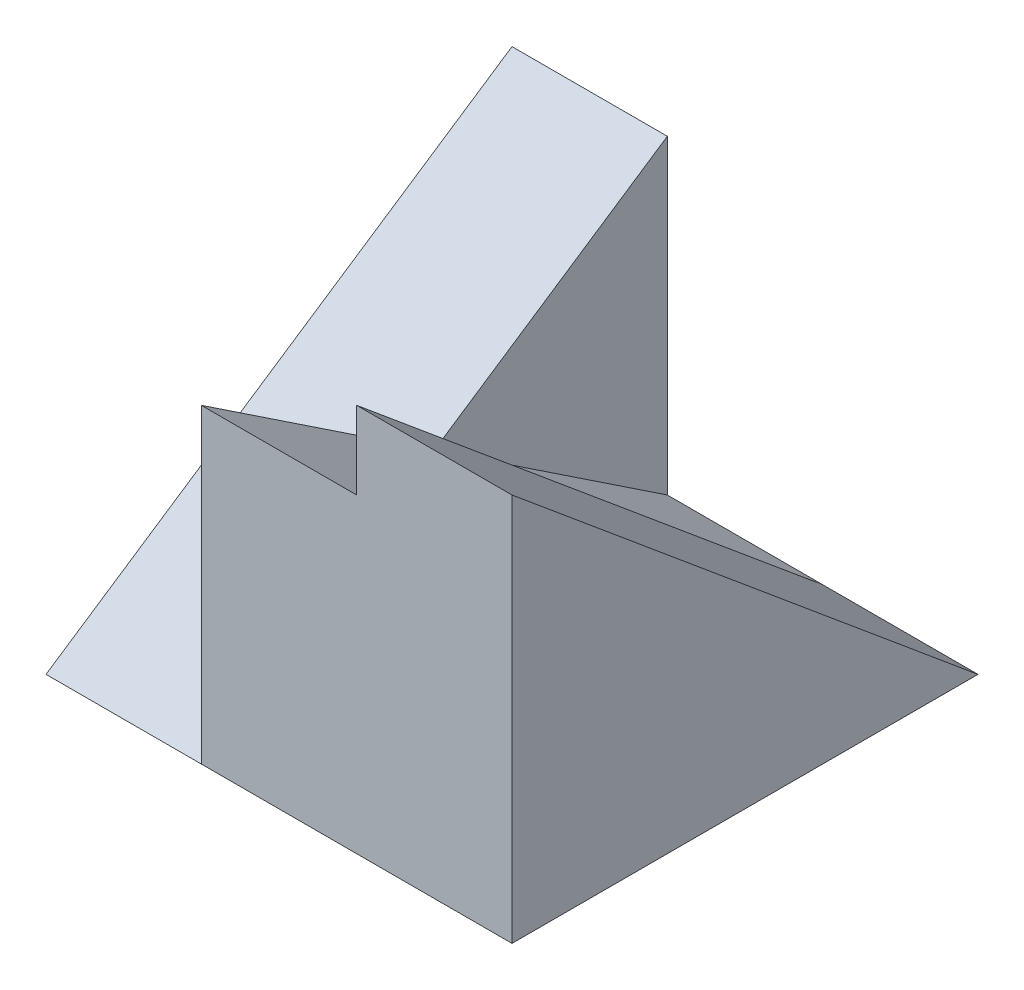
ISO-10303-21;
HEADER;
FILE_DESCRIPTION(('STEP AP214'),'2;1');
FILE_NAME('part.step','',(''),(''),'','','');
FILE_SCHEMA(('AUTOMOTIVE_DESIGN { 1 0 10303 214 1 1 1 1 }'));
ENDSEC;
DATA;
#1=APPLICATION_CONTEXT('core data for automotive mechanical design processes');
#2=APPLICATION_PROTOCOL_DEFINITION('international standard','automotive_design',2000,#1);
#3=PRODUCT_CONTEXT('',#1,'mechanical');
#4=PRODUCT('Part','Part','',(#3));
#5=PRODUCT_RELATED_PRODUCT_CATEGORY('part','',(#4));
#6=PRODUCT_DEFINITION_FORMATION('','',#4);
#7=PRODUCT_DEFINITION_CONTEXT('part definition',#1,'design');
#8=PRODUCT_DEFINITION('design','',#6,#7);
#9=PRODUCT_DEFINITION_SHAPE('','',#8);
#10=(LENGTH_UNIT() NAMED_UNIT(*) SI_UNIT(.MILLI.,.METRE.));
#11=(NAMED_UNIT(*) PLANE_ANGLE_UNIT() SI_UNIT($,.RADIAN.));
#12=(NAMED_UNIT(*) SI_UNIT($,.STERADIAN.) SOLID_ANGLE_UNIT());
#13=UNCERTAINTY_MEASURE_WITH_UNIT(LENGTH_MEASURE(1.E-05),#10,'distance_accuracy_value','');
#14=(GEOMETRIC_REPRESENTATION_CONTEXT(3) GLOBAL_UNCERTAINTY_ASSIGNED_CONTEXT((#13)) GLOBAL_UNIT_ASSIGNED_CONTEXT((#10,
#11,#12)) REPRESENTATION_CONTEXT('',''));
#15=CARTESIAN_POINT('',(0.,0.,0.));
#16=DIRECTION('',(0.,0.,1.));
#17=DIRECTION('',(1.,0.,0.));
#18=AXIS2_PLACEMENT_3D('',#15,#16,#17);
#19=CARTESIAN_POINT('',(3.,5.,3.));
#20=DIRECTION('',(-1.,0.,0.));
#21=DIRECTION('',(0.,0.,1.));
#22=AXIS2_PLACEMENT_3D('',#19,#20,#21);
#23=PLANE('',#22);
#24=DIRECTION('',(0.,-0.64018439966448,-0.768221279597376));
#25=VECTOR('',#24,1.);
#26=CARTESIAN_POINT('',(3.,1.47540983606557,-1.22950819672131));
#27=LINE('',#26,#25);
#28=CARTESIAN_POINT('',(3.,5.,3.));
#29=VERTEX_POINT('',#28);
#30=CARTESIAN_POINT('',(3.,0.,-3.));
#31=VERTEX_POINT('',#30);
#32=EDGE_CURVE('E94',#29,#31,#27,.T.);
#33=ORIENTED_EDGE('',*,*,#32,.F.);
#34=DIRECTION('',(0.,-1.,0.));
#35=VECTOR('',#34,1.);
#36=CARTESIAN_POINT('',(3.,5.,3.));
#37=LINE('',#36,#35);
#38=CARTESIAN_POINT('',(3.,0.,3.));
#39=VERTEX_POINT('',#38);
#40=EDGE_CURVE('E100',#29,#39,#37,.T.);
#41=ORIENTED_EDGE('',*,*,#40,.T.);
#42=DIRECTION('',(0.,0.,-1.));
#43=VECTOR('',#42,1.);
#44=CARTESIAN_POINT('',(3.,0.,3.));
#45=LINE('',#44,#43);
#46=EDGE_CURVE('E106',#39,#31,#45,.T.);
#47=ORIENTED_EDGE('',*,*,#46,.T.);
#48=EDGE_LOOP('',(#33,#41,#47));
#49=FACE_BOUND('',#48,.T.);
#50=ADVANCED_FACE('F33',(#49),#23,.F.);
#51=CARTESIAN_POINT('',(1.,0.,0.));
#52=DIRECTION('',(-1.,0.,0.));
#53=DIRECTION('',(0.,0.,1.));
#54=AXIS2_PLACEMENT_3D('',#51,#52,#53);
#55=PLANE('',#54);
#56=DIRECTION('',(0.,1.,0.));
#57=VECTOR('',#56,1.);
#58=CARTESIAN_POINT('',(1.,0.,3.));
#59=LINE('',#58,#57);
#60=CARTESIAN_POINT('',(1.,4.,3.));
#61=VERTEX_POINT('',#60);
#62=CARTESIAN_POINT('',(1.,5.,3.));
#63=VERTEX_POINT('',#62);
#64=EDGE_CURVE('E135',#61,#63,#59,.T.);
#65=ORIENTED_EDGE('',*,*,#64,.T.);
#66=DIRECTION('',(0.,-0.64018439966448,-0.768221279597376));
#67=VECTOR('',#66,1.);
#68=CARTESIAN_POINT('',(1.,1.47540983606557,-1.22950819672131));
#69=LINE('',#68,#67);
#70=CARTESIAN_POINT('',(1.,0.,-3.));
#71=VERTEX_POINT('',#70);
#72=EDGE_CURVE('E97',#63,#71,#69,.T.);
#73=ORIENTED_EDGE('',*,*,#72,.T.);
#74=DIRECTION('',(0.,0.554700196225229,0.832050294337844));
#75=VECTOR('',#74,1.);
#76=CARTESIAN_POINT('',(1.,1.38461538461538,-0.923076923076923));
#77=LINE('',#76,#75);
#78=EDGE_CURVE('E140',#71,#61,#77,.T.);
#79=ORIENTED_EDGE('',*,*,#78,.T.);
#80=EDGE_LOOP('',(#65,#73,#79));
#81=FACE_BOUND('',#80,.T.);
#82=ADVANCED_FACE('F147',(#81),#55,.T.);
#83=CARTESIAN_POINT('',(-3.,5.,3.));
#84=DIRECTION('',(0.,0.,-1.));
#85=DIRECTION('',(-1.,0.,0.));
#86=AXIS2_PLACEMENT_3D('',#83,#84,#85);
#87=PLANE('',#86);
#88=ORIENTED_EDGE('',*,*,#64,.F.);
#89=DIRECTION('',(-1.,0.,0.));
#90=VECTOR('',#89,1.);
#91=CARTESIAN_POINT('',(1.,4.,3.));
#92=LINE('',#91,#90);
#93=CARTESIAN_POINT('',(-1.,4.,3.));
#94=VERTEX_POINT('',#93);
#95=EDGE_CURVE('E132',#61,#94,#92,.T.);
#96=ORIENTED_EDGE('',*,*,#95,.T.);
#97=DIRECTION('',(0.,1.,0.));
#98=VECTOR('',#97,1.);
#99=CARTESIAN_POINT('',(-1.,0.,3.));
#100=LINE('',#99,#98);
#101=CARTESIAN_POINT('',(-1.,0.,3.));
#102=VERTEX_POINT('',#101);
#103=EDGE_CURVE('E123',#102,#94,#100,.T.);
#104=ORIENTED_EDGE('',*,*,#103,.F.);
#105=DIRECTION('',(1.,0.,0.));
#106=VECTOR('',#105,1.);
#107=CARTESIAN_POINT('',(-3.,0.,3.));
#108=LINE('',#107,#106);
#109=EDGE_CURVE('E54',#102,#39,#108,.T.);
#110=ORIENTED_EDGE('',*,*,#109,.T.);
#111=ORIENTED_EDGE('',*,*,#40,.F.);
#112=DIRECTION('',(1.,0.,0.));
#113=VECTOR('',#112,1.);
#114=CARTESIAN_POINT('',(-3.,5.,3.));
#115=LINE('',#114,#113);
#116=EDGE_CURVE('E91',#63,#29,#115,.T.);
#117=ORIENTED_EDGE('',*,*,#116,.F.);
#118=EDGE_LOOP('',(#88,#96,#104,#110,#111,#117));
#119=FACE_BOUND('',#118,.T.);
#120=ADVANCED_FACE('F108',(#119),#87,.F.);
#121=CARTESIAN_POINT('',(-3.,5.,-3.));
#122=DIRECTION('',(0.,0.,1.));
#123=DIRECTION('',(1.,0.,0.));
#124=AXIS2_PLACEMENT_3D('',#121,#122,#123);
#125=PLANE('',#124);
#126=DIRECTION('',(-1.,0.,0.));
#127=VECTOR('',#126,1.);
#128=CARTESIAN_POINT('',(-1.,4.,-3.));
#129=LINE('',#128,#127);
#130=CARTESIAN_POINT('',(-1.,4.,-3.));
#131=VERTEX_POINT('',#130);
#132=CARTESIAN_POINT('',(-3.,4.,-3.));
#133=VERTEX_POINT('',#132);
#134=EDGE_CURVE('E120',#131,#133,#129,.T.);
#135=ORIENTED_EDGE('',*,*,#134,.F.);
#136=DIRECTION('',(0.,-1.,0.));
#137=VECTOR('',#136,1.);
#138=CARTESIAN_POINT('',(-1.,0.,-3.));
#139=LINE('',#138,#137);
#140=CARTESIAN_POINT('',(-1.,0.,-3.));
#141=VERTEX_POINT('',#140);
#142=EDGE_CURVE('E137',#131,#141,#139,.T.);
#143=ORIENTED_EDGE('',*,*,#142,.T.);
#144=DIRECTION('',(-1.,0.,0.));
#145=VECTOR('',#144,1.);
#146=CARTESIAN_POINT('',(-3.,0.,-3.));
#147=LINE('',#146,#145);
#148=CARTESIAN_POINT('',(-3.,0.,-3.));
#149=VERTEX_POINT('',#148);
#150=EDGE_CURVE('E119',#141,#149,#147,.T.);
#151=ORIENTED_EDGE('',*,*,#150,.T.);
#152=DIRECTION('',(0.,-1.,0.));
#153=VECTOR('',#152,1.);
#154=CARTESIAN_POINT('',(-3.,5.,-3.));
#155=LINE('',#154,#153);
#156=EDGE_CURVE('E40',#133,#149,#155,.T.);
#157=ORIENTED_EDGE('',*,*,#156,.F.);
#158=EDGE_LOOP('',(#135,#143,#151,#157));
#159=FACE_BOUND('',#158,.T.);
#160=ADVANCED_FACE('F158',(#159),#125,.F.);
#161=CARTESIAN_POINT('',(-3.,5.,3.));
#162=DIRECTION('',(1.,0.,0.));
#163=DIRECTION('',(0.,0.,-1.));
#164=AXIS2_PLACEMENT_3D('',#161,#162,#163);
#165=PLANE('',#164);
#166=DIRECTION('',(0.,0.,1.));
#167=VECTOR('',#166,1.);
#168=CARTESIAN_POINT('',(-3.,0.,3.));
#169=LINE('',#168,#167);
#170=CARTESIAN_POINT('',(-3.,0.,3.));
#171=VERTEX_POINT('',#170);
#172=EDGE_CURVE('E114',#149,#171,#169,.T.);
#173=ORIENTED_EDGE('',*,*,#172,.T.);
#174=DIRECTION('',(0.,-0.554700196225229,0.832050294337844));
#175=VECTOR('',#174,1.);
#176=CARTESIAN_POINT('',(-3.,1.38461538461538,0.923076923076923));
#177=LINE('',#176,#175);
#178=EDGE_CURVE('E124',#133,#171,#177,.T.);
#179=ORIENTED_EDGE('',*,*,#178,.F.);
#180=ORIENTED_EDGE('',*,*,#156,.T.);
#181=EDGE_LOOP('',(#173,#179,#180));
#182=FACE_BOUND('',#181,.T.);
#183=ADVANCED_FACE('F161',(#182),#165,.F.);
#184=CARTESIAN_POINT('',(0.,0.,0.));
#185=DIRECTION('',(0.,-1.,0.));
#186=DIRECTION('',(0.,0.,-1.));
#187=AXIS2_PLACEMENT_3D('',#184,#185,#186);
#188=PLANE('',#187);
#189=ORIENTED_EDGE('',*,*,#46,.F.);
#190=ORIENTED_EDGE('',*,*,#109,.F.);
#191=EDGE_CURVE('E101',#171,#102,#108,.T.);
#192=ORIENTED_EDGE('',*,*,#191,.F.);
#193=ORIENTED_EDGE('',*,*,#172,.F.);
#194=ORIENTED_EDGE('',*,*,#150,.F.);
#195=DIRECTION('',(-1.,0.,0.));
#196=VECTOR('',#195,1.);
#197=CARTESIAN_POINT('',(1.,0.,-3.));
#198=LINE('',#197,#196);
#199=EDGE_CURVE('E127',#71,#141,#198,.T.);
#200=ORIENTED_EDGE('',*,*,#199,.F.);
#201=EDGE_CURVE('E117',#31,#71,#147,.T.);
#202=ORIENTED_EDGE('',*,*,#201,.F.);
#203=EDGE_LOOP('',(#189,#190,#192,#193,#194,#200,#202));
#204=FACE_BOUND('',#203,.T.);
#205=ADVANCED_FACE('F152',(#204),#188,.T.);
#206=CARTESIAN_POINT('',(-1.,1.38461538461538,0.923076923076923));
#207=DIRECTION('',(0.,-0.832050294337844,-0.554700196225229));
#208=DIRECTION('',(0.,0.554700196225229,-0.832050294337844));
#209=AXIS2_PLACEMENT_3D('',#206,#207,#208);
#210=PLANE('',#209);
#211=ORIENTED_EDGE('',*,*,#178,.T.);
#212=ORIENTED_EDGE('',*,*,#191,.T.);
#213=DIRECTION('',(0.,-0.554700196225229,0.832050294337844));
#214=VECTOR('',#213,1.);
#215=CARTESIAN_POINT('',(-1.,1.38461538461538,0.923076923076923));
#216=LINE('',#215,#214);
#217=CARTESIAN_POINT('',(-1.,2.,0.));
#218=VERTEX_POINT('',#217);
#219=EDGE_CURVE('E126',#218,#102,#216,.T.);
#220=ORIENTED_EDGE('',*,*,#219,.F.);
#221=EDGE_CURVE('E130',#131,#218,#216,.T.);
#222=ORIENTED_EDGE('',*,*,#221,.F.);
#223=ORIENTED_EDGE('',*,*,#134,.T.);
#224=EDGE_LOOP('',(#211,#212,#220,#222,#223));
#225=FACE_BOUND('',#224,.T.);
#226=ADVANCED_FACE('F163',(#225),#210,.F.);
#227=CARTESIAN_POINT('',(-1.,0.,0.));
#228=DIRECTION('',(-1.,0.,0.));
#229=DIRECTION('',(0.,0.,1.));
#230=AXIS2_PLACEMENT_3D('',#227,#228,#229);
#231=PLANE('',#230);
#232=DIRECTION('',(0.,0.554700196225229,0.832050294337844));
#233=VECTOR('',#232,1.);
#234=CARTESIAN_POINT('',(-1.,1.38461538461538,-0.923076923076923));
#235=LINE('',#234,#233);
#236=EDGE_CURVE('E11',#218,#94,#235,.T.);
#237=ORIENTED_EDGE('',*,*,#236,.F.);
#238=ORIENTED_EDGE('',*,*,#219,.T.);
#239=ORIENTED_EDGE('',*,*,#103,.T.);
#240=EDGE_LOOP('',(#237,#238,#239));
#241=FACE_BOUND('',#240,.T.);
#242=ADVANCED_FACE('F170',(#241),#231,.T.);
#243=CARTESIAN_POINT('',(-1.,0.,0.));
#244=DIRECTION('',(-1.,0.,0.));
#245=DIRECTION('',(0.,0.,1.));
#246=AXIS2_PLACEMENT_3D('',#243,#244,#245);
#247=PLANE('',#246);
#248=DIRECTION('',(0.,0.554700196225229,0.832050294337844));
#249=VECTOR('',#248,1.);
#250=CARTESIAN_POINT('',(-1.,1.38461538461538,-0.923076923076923));
#251=LINE('',#250,#249);
#252=EDGE_CURVE('E46',#141,#218,#251,.T.);
#253=ORIENTED_EDGE('',*,*,#252,.F.);
#254=ORIENTED_EDGE('',*,*,#142,.F.);
#255=ORIENTED_EDGE('',*,*,#221,.T.);
#256=EDGE_LOOP('',(#253,#254,#255));
#257=FACE_BOUND('',#256,.T.);
#258=ADVANCED_FACE('F168',(#257),#247,.F.);
#259=CARTESIAN_POINT('',(1.,1.38461538461538,-0.923076923076923));
#260=DIRECTION('',(0.,-0.832050294337844,0.554700196225229));
#261=DIRECTION('',(0.,-0.554700196225229,-0.832050294337844));
#262=AXIS2_PLACEMENT_3D('',#259,#260,#261);
#263=PLANE('',#262);
#264=ORIENTED_EDGE('',*,*,#252,.T.);
#265=ORIENTED_EDGE('',*,*,#236,.T.);
#266=ORIENTED_EDGE('',*,*,#95,.F.);
#267=ORIENTED_EDGE('',*,*,#78,.F.);
#268=ORIENTED_EDGE('',*,*,#199,.T.);
#269=EDGE_LOOP('',(#264,#265,#266,#267,#268));
#270=FACE_BOUND('',#269,.T.);
#271=ADVANCED_FACE('F149',(#270),#263,.F.);
#272=CARTESIAN_POINT('',(3.,1.47540983606557,-1.22950819672131));
#273=DIRECTION('',(0.,0.768221279597376,-0.64018439966448));
#274=DIRECTION('',(0.,0.64018439966448,0.768221279597376));
#275=AXIS2_PLACEMENT_3D('',#272,#273,#274);
#276=PLANE('',#275);
#277=ORIENTED_EDGE('',*,*,#72,.F.);
#278=ORIENTED_EDGE('',*,*,#116,.T.);
#279=ORIENTED_EDGE('',*,*,#32,.T.);
#280=ORIENTED_EDGE('',*,*,#201,.T.);
#281=EDGE_LOOP('',(#277,#278,#279,#280));
#282=FACE_BOUND('',#281,.T.);
#283=ADVANCED_FACE('F93',(#282),#276,.T.);
#284=CLOSED_SHELL('',(#50,#82,#120,#160,#183,#205,#226,#242,#258,#271,#283));
#285=MANIFOLD_SOLID_BREP('B2',#284);
#286=ADVANCED_BREP_SHAPE_REPRESENTATION('',(#18,#285),#14);
#287=SHAPE_DEFINITION_REPRESENTATION(#9,#286);
ENDSEC;
END-ISO-10303-21;
